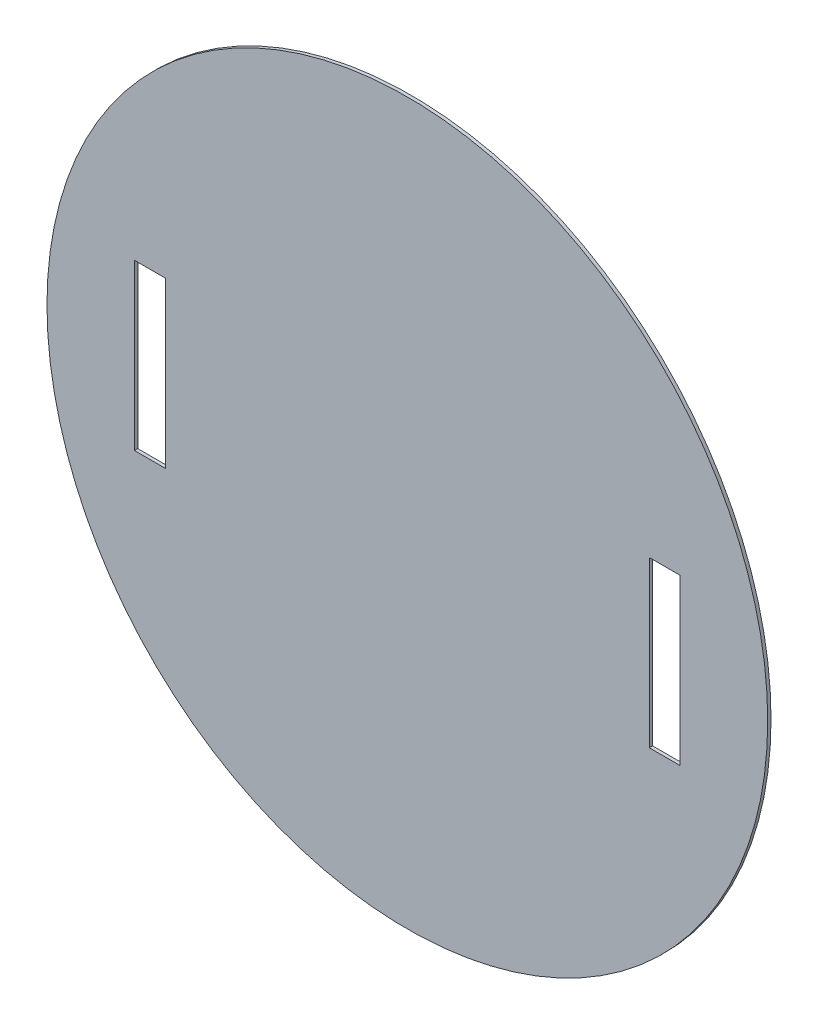
ISO-10303-21;
HEADER;
FILE_DESCRIPTION(('STEP AP214'),'2;1');
FILE_NAME('part.step','',(''),(''),'','','');
FILE_SCHEMA(('AUTOMOTIVE_DESIGN { 1 0 10303 214 1 1 1 1 }'));
ENDSEC;
DATA;
#1=APPLICATION_CONTEXT('core data for automotive mechanical design processes');
#2=APPLICATION_PROTOCOL_DEFINITION('international standard','automotive_design',2000,#1);
#3=PRODUCT_CONTEXT('',#1,'mechanical');
#4=PRODUCT('Part','Part','',(#3));
#5=PRODUCT_RELATED_PRODUCT_CATEGORY('part','',(#4));
#6=PRODUCT_DEFINITION_FORMATION('','',#4);
#7=PRODUCT_DEFINITION_CONTEXT('part definition',#1,'design');
#8=PRODUCT_DEFINITION('design','',#6,#7);
#9=PRODUCT_DEFINITION_SHAPE('','',#8);
#10=(LENGTH_UNIT() NAMED_UNIT(*) SI_UNIT(.MILLI.,.METRE.));
#11=(NAMED_UNIT(*) PLANE_ANGLE_UNIT() SI_UNIT($,.RADIAN.));
#12=(NAMED_UNIT(*) SI_UNIT($,.STERADIAN.) SOLID_ANGLE_UNIT());
#13=UNCERTAINTY_MEASURE_WITH_UNIT(LENGTH_MEASURE(1.E-05),#10,'distance_accuracy_value','');
#14=(GEOMETRIC_REPRESENTATION_CONTEXT(3) GLOBAL_UNCERTAINTY_ASSIGNED_CONTEXT((#13)) GLOBAL_UNIT_ASSIGNED_CONTEXT((#10,
#11,#12)) REPRESENTATION_CONTEXT('',''));
#15=CARTESIAN_POINT('',(0.,0.,0.));
#16=DIRECTION('',(0.,0.,1.));
#17=DIRECTION('',(1.,0.,0.));
#18=AXIS2_PLACEMENT_3D('',#15,#16,#17);
#19=CARTESIAN_POINT('',(0.,0.,1.6));
#20=DIRECTION('',(0.,0.,-1.));
#21=DIRECTION('',(-1.,0.,0.));
#22=AXIS2_PLACEMENT_3D('',#19,#20,#21);
#23=CYLINDRICAL_SURFACE('',#22,175.);
#24=CARTESIAN_POINT('',(0.,0.,1.6));
#25=DIRECTION('',(0.,0.,1.));
#26=DIRECTION('',(1.,0.,0.));
#27=AXIS2_PLACEMENT_3D('',#24,#25,#26);
#28=CIRCLE('',#27,175.);
#29=CARTESIAN_POINT('',(175.,0.,1.6));
#30=VERTEX_POINT('',#29);
#31=EDGE_CURVE('E11',#30,#30,#28,.T.);
#32=ORIENTED_EDGE('',*,*,#31,.F.);
#33=EDGE_LOOP('',(#32));
#34=FACE_BOUND('',#33,.T.);
#35=CARTESIAN_POINT('',(0.,0.,0.));
#36=DIRECTION('',(0.,0.,1.));
#37=DIRECTION('',(1.,0.,0.));
#38=AXIS2_PLACEMENT_3D('',#35,#36,#37);
#39=CIRCLE('',#38,175.);
#40=CARTESIAN_POINT('',(175.,0.,0.));
#41=VERTEX_POINT('',#40);
#42=EDGE_CURVE('E36',#41,#41,#39,.T.);
#43=ORIENTED_EDGE('',*,*,#42,.T.);
#44=EDGE_LOOP('',(#43));
#45=FACE_BOUND('',#44,.T.);
#46=ADVANCED_FACE('F33',(#34,#45),#23,.T.);
#47=CARTESIAN_POINT('',(0.,0.,1.6));
#48=DIRECTION('',(0.,0.,1.));
#49=DIRECTION('',(1.,0.,0.));
#50=AXIS2_PLACEMENT_3D('',#47,#48,#49);
#51=PLANE('',#50);
#52=DIRECTION('',(0.,-1.,0.));
#53=VECTOR('',#52,1.);
#54=CARTESIAN_POINT('',(-132.5,40.,1.6));
#55=LINE('',#54,#53);
#56=CARTESIAN_POINT('',(-132.5,40.,1.6));
#57=VERTEX_POINT('',#56);
#58=CARTESIAN_POINT('',(-132.5,-40.,1.6));
#59=VERTEX_POINT('',#58);
#60=EDGE_CURVE('E47',#57,#59,#55,.T.);
#61=ORIENTED_EDGE('',*,*,#60,.F.);
#62=DIRECTION('',(-1.,0.,0.));
#63=VECTOR('',#62,1.);
#64=CARTESIAN_POINT('',(-132.5,40.,1.6));
#65=LINE('',#64,#63);
#66=CARTESIAN_POINT('',(-117.5,40.,1.6));
#67=VERTEX_POINT('',#66);
#68=EDGE_CURVE('E118',#67,#57,#65,.T.);
#69=ORIENTED_EDGE('',*,*,#68,.F.);
#70=DIRECTION('',(0.,1.,0.));
#71=VECTOR('',#70,1.);
#72=CARTESIAN_POINT('',(-117.5,40.,1.6));
#73=LINE('',#72,#71);
#74=CARTESIAN_POINT('',(-117.5,-40.,1.6));
#75=VERTEX_POINT('',#74);
#76=EDGE_CURVE('E121',#75,#67,#73,.T.);
#77=ORIENTED_EDGE('',*,*,#76,.F.);
#78=DIRECTION('',(1.,0.,0.));
#79=VECTOR('',#78,1.);
#80=CARTESIAN_POINT('',(-132.5,-40.,1.6));
#81=LINE('',#80,#79);
#82=EDGE_CURVE('E127',#59,#75,#81,.T.);
#83=ORIENTED_EDGE('',*,*,#82,.F.);
#84=EDGE_LOOP('',(#61,#69,#77,#83));
#85=FACE_BOUND('',#84,.T.);
#86=DIRECTION('',(0.,1.,0.));
#87=VECTOR('',#86,1.);
#88=CARTESIAN_POINT('',(132.5,40.,1.6));
#89=LINE('',#88,#87);
#90=CARTESIAN_POINT('',(132.5,-40.,1.6));
#91=VERTEX_POINT('',#90);
#92=CARTESIAN_POINT('',(132.5,40.,1.6));
#93=VERTEX_POINT('',#92);
#94=EDGE_CURVE('E55',#91,#93,#89,.T.);
#95=ORIENTED_EDGE('',*,*,#94,.F.);
#96=DIRECTION('',(1.,0.,0.));
#97=VECTOR('',#96,1.);
#98=CARTESIAN_POINT('',(132.5,-40.,1.6));
#99=LINE('',#98,#97);
#100=CARTESIAN_POINT('',(117.5,-40.,1.6));
#101=VERTEX_POINT('',#100);
#102=EDGE_CURVE('E141',#101,#91,#99,.T.);
#103=ORIENTED_EDGE('',*,*,#102,.F.);
#104=DIRECTION('',(0.,-1.,0.));
#105=VECTOR('',#104,1.);
#106=CARTESIAN_POINT('',(117.5,40.,1.6));
#107=LINE('',#106,#105);
#108=CARTESIAN_POINT('',(117.5,40.,1.6));
#109=VERTEX_POINT('',#108);
#110=EDGE_CURVE('E155',#109,#101,#107,.T.);
#111=ORIENTED_EDGE('',*,*,#110,.F.);
#112=DIRECTION('',(-1.,0.,0.));
#113=VECTOR('',#112,1.);
#114=CARTESIAN_POINT('',(132.5,40.,1.6));
#115=LINE('',#114,#113);
#116=EDGE_CURVE('E152',#93,#109,#115,.T.);
#117=ORIENTED_EDGE('',*,*,#116,.F.);
#118=EDGE_LOOP('',(#95,#103,#111,#117));
#119=FACE_BOUND('',#118,.T.);
#120=ORIENTED_EDGE('',*,*,#31,.T.);
#121=EDGE_LOOP('',(#120));
#122=FACE_BOUND('',#121,.T.);
#123=ADVANCED_FACE('F173',(#85,#119,#122),#51,.T.);
#124=CARTESIAN_POINT('',(0.,0.,0.));
#125=DIRECTION('',(0.,0.,1.));
#126=DIRECTION('',(1.,0.,0.));
#127=AXIS2_PLACEMENT_3D('',#124,#125,#126);
#128=PLANE('',#127);
#129=DIRECTION('',(-1.,0.,0.));
#130=VECTOR('',#129,1.);
#131=CARTESIAN_POINT('',(-132.5,40.,0.));
#132=LINE('',#131,#130);
#133=CARTESIAN_POINT('',(-117.5,40.,0.));
#134=VERTEX_POINT('',#133);
#135=CARTESIAN_POINT('',(-132.5,40.,0.));
#136=VERTEX_POINT('',#135);
#137=EDGE_CURVE('E105',#134,#136,#132,.T.);
#138=ORIENTED_EDGE('',*,*,#137,.T.);
#139=DIRECTION('',(0.,-1.,0.));
#140=VECTOR('',#139,1.);
#141=CARTESIAN_POINT('',(-132.5,40.,0.));
#142=LINE('',#141,#140);
#143=CARTESIAN_POINT('',(-132.5,-40.,0.));
#144=VERTEX_POINT('',#143);
#145=EDGE_CURVE('E99',#136,#144,#142,.T.);
#146=ORIENTED_EDGE('',*,*,#145,.T.);
#147=DIRECTION('',(1.,0.,0.));
#148=VECTOR('',#147,1.);
#149=CARTESIAN_POINT('',(-132.5,-40.,0.));
#150=LINE('',#149,#148);
#151=CARTESIAN_POINT('',(-117.5,-40.,0.));
#152=VERTEX_POINT('',#151);
#153=EDGE_CURVE('E109',#144,#152,#150,.T.);
#154=ORIENTED_EDGE('',*,*,#153,.T.);
#155=DIRECTION('',(0.,1.,0.));
#156=VECTOR('',#155,1.);
#157=CARTESIAN_POINT('',(-117.5,40.,0.));
#158=LINE('',#157,#156);
#159=EDGE_CURVE('E113',#152,#134,#158,.T.);
#160=ORIENTED_EDGE('',*,*,#159,.T.);
#161=EDGE_LOOP('',(#138,#146,#154,#160));
#162=FACE_BOUND('',#161,.T.);
#163=DIRECTION('',(1.,0.,0.));
#164=VECTOR('',#163,1.);
#165=CARTESIAN_POINT('',(132.5,-40.,0.));
#166=LINE('',#165,#164);
#167=CARTESIAN_POINT('',(117.5,-40.,0.));
#168=VERTEX_POINT('',#167);
#169=CARTESIAN_POINT('',(132.5,-40.,0.));
#170=VERTEX_POINT('',#169);
#171=EDGE_CURVE('E147',#168,#170,#166,.T.);
#172=ORIENTED_EDGE('',*,*,#171,.T.);
#173=DIRECTION('',(0.,1.,0.));
#174=VECTOR('',#173,1.);
#175=CARTESIAN_POINT('',(132.5,40.,0.));
#176=LINE('',#175,#174);
#177=CARTESIAN_POINT('',(132.5,40.,0.));
#178=VERTEX_POINT('',#177);
#179=EDGE_CURVE('E137',#170,#178,#176,.T.);
#180=ORIENTED_EDGE('',*,*,#179,.T.);
#181=DIRECTION('',(-1.,0.,0.));
#182=VECTOR('',#181,1.);
#183=CARTESIAN_POINT('',(132.5,40.,0.));
#184=LINE('',#183,#182);
#185=CARTESIAN_POINT('',(117.5,40.,0.));
#186=VERTEX_POINT('',#185);
#187=EDGE_CURVE('E140',#178,#186,#184,.T.);
#188=ORIENTED_EDGE('',*,*,#187,.T.);
#189=DIRECTION('',(0.,-1.,0.));
#190=VECTOR('',#189,1.);
#191=CARTESIAN_POINT('',(117.5,40.,0.));
#192=LINE('',#191,#190);
#193=EDGE_CURVE('E144',#186,#168,#192,.T.);
#194=ORIENTED_EDGE('',*,*,#193,.T.);
#195=EDGE_LOOP('',(#172,#180,#188,#194));
#196=FACE_BOUND('',#195,.T.);
#197=ORIENTED_EDGE('',*,*,#42,.F.);
#198=EDGE_LOOP('',(#197));
#199=FACE_BOUND('',#198,.T.);
#200=ADVANCED_FACE('F115',(#162,#196,#199),#128,.F.);
#201=CARTESIAN_POINT('',(132.5,40.,0.));
#202=DIRECTION('',(1.,0.,0.));
#203=DIRECTION('',(0.,0.,-1.));
#204=AXIS2_PLACEMENT_3D('',#201,#202,#203);
#205=PLANE('',#204);
#206=ORIENTED_EDGE('',*,*,#94,.T.);
#207=DIRECTION('',(0.,0.,1.));
#208=VECTOR('',#207,1.);
#209=CARTESIAN_POINT('',(132.5,40.,0.));
#210=LINE('',#209,#208);
#211=EDGE_CURVE('E150',#178,#93,#210,.T.);
#212=ORIENTED_EDGE('',*,*,#211,.F.);
#213=ORIENTED_EDGE('',*,*,#179,.F.);
#214=DIRECTION('',(0.,0.,1.));
#215=VECTOR('',#214,1.);
#216=CARTESIAN_POINT('',(132.5,-40.,0.));
#217=LINE('',#216,#215);
#218=EDGE_CURVE('E128',#170,#91,#217,.T.);
#219=ORIENTED_EDGE('',*,*,#218,.T.);
#220=EDGE_LOOP('',(#206,#212,#213,#219));
#221=FACE_BOUND('',#220,.T.);
#222=ADVANCED_FACE('F180',(#221),#205,.F.);
#223=CARTESIAN_POINT('',(132.5,-40.,0.));
#224=DIRECTION('',(0.,-1.,0.));
#225=DIRECTION('',(0.,0.,-1.));
#226=AXIS2_PLACEMENT_3D('',#223,#224,#225);
#227=PLANE('',#226);
#228=ORIENTED_EDGE('',*,*,#102,.T.);
#229=ORIENTED_EDGE('',*,*,#218,.F.);
#230=ORIENTED_EDGE('',*,*,#171,.F.);
#231=DIRECTION('',(0.,0.,1.));
#232=VECTOR('',#231,1.);
#233=CARTESIAN_POINT('',(117.5,-40.,0.));
#234=LINE('',#233,#232);
#235=EDGE_CURVE('E161',#168,#101,#234,.T.);
#236=ORIENTED_EDGE('',*,*,#235,.T.);
#237=EDGE_LOOP('',(#228,#229,#230,#236));
#238=FACE_BOUND('',#237,.T.);
#239=ADVANCED_FACE('F182',(#238),#227,.F.);
#240=CARTESIAN_POINT('',(117.5,40.,0.));
#241=DIRECTION('',(-1.,0.,0.));
#242=DIRECTION('',(0.,0.,1.));
#243=AXIS2_PLACEMENT_3D('',#240,#241,#242);
#244=PLANE('',#243);
#245=ORIENTED_EDGE('',*,*,#110,.T.);
#246=ORIENTED_EDGE('',*,*,#235,.F.);
#247=ORIENTED_EDGE('',*,*,#193,.F.);
#248=DIRECTION('',(0.,0.,1.));
#249=VECTOR('',#248,1.);
#250=CARTESIAN_POINT('',(117.5,40.,0.));
#251=LINE('',#250,#249);
#252=EDGE_CURVE('E163',#186,#109,#251,.T.);
#253=ORIENTED_EDGE('',*,*,#252,.T.);
#254=EDGE_LOOP('',(#245,#246,#247,#253));
#255=FACE_BOUND('',#254,.T.);
#256=ADVANCED_FACE('F177',(#255),#244,.F.);
#257=CARTESIAN_POINT('',(132.5,40.,0.));
#258=DIRECTION('',(0.,1.,0.));
#259=DIRECTION('',(0.,0.,1.));
#260=AXIS2_PLACEMENT_3D('',#257,#258,#259);
#261=PLANE('',#260);
#262=ORIENTED_EDGE('',*,*,#116,.T.);
#263=ORIENTED_EDGE('',*,*,#252,.F.);
#264=ORIENTED_EDGE('',*,*,#187,.F.);
#265=ORIENTED_EDGE('',*,*,#211,.T.);
#266=EDGE_LOOP('',(#262,#263,#264,#265));
#267=FACE_BOUND('',#266,.T.);
#268=ADVANCED_FACE('F168',(#267),#261,.F.);
#269=CARTESIAN_POINT('',(-132.5,40.,0.));
#270=DIRECTION('',(-1.,0.,0.));
#271=DIRECTION('',(0.,0.,1.));
#272=AXIS2_PLACEMENT_3D('',#269,#270,#271);
#273=PLANE('',#272);
#274=ORIENTED_EDGE('',*,*,#60,.T.);
#275=DIRECTION('',(0.,0.,1.));
#276=VECTOR('',#275,1.);
#277=CARTESIAN_POINT('',(-132.5,-40.,0.));
#278=LINE('',#277,#276);
#279=EDGE_CURVE('E95',#144,#59,#278,.T.);
#280=ORIENTED_EDGE('',*,*,#279,.F.);
#281=ORIENTED_EDGE('',*,*,#145,.F.);
#282=DIRECTION('',(0.,0.,1.));
#283=VECTOR('',#282,1.);
#284=CARTESIAN_POINT('',(-132.5,40.,0.));
#285=LINE('',#284,#283);
#286=EDGE_CURVE('E132',#136,#57,#285,.T.);
#287=ORIENTED_EDGE('',*,*,#286,.T.);
#288=EDGE_LOOP('',(#274,#280,#281,#287));
#289=FACE_BOUND('',#288,.T.);
#290=ADVANCED_FACE('F97',(#289),#273,.F.);
#291=CARTESIAN_POINT('',(-132.5,40.,0.));
#292=DIRECTION('',(0.,1.,0.));
#293=DIRECTION('',(0.,0.,1.));
#294=AXIS2_PLACEMENT_3D('',#291,#292,#293);
#295=PLANE('',#294);
#296=ORIENTED_EDGE('',*,*,#68,.T.);
#297=ORIENTED_EDGE('',*,*,#286,.F.);
#298=ORIENTED_EDGE('',*,*,#137,.F.);
#299=DIRECTION('',(0.,0.,1.));
#300=VECTOR('',#299,1.);
#301=CARTESIAN_POINT('',(-117.5,40.,0.));
#302=LINE('',#301,#300);
#303=EDGE_CURVE('E134',#134,#67,#302,.T.);
#304=ORIENTED_EDGE('',*,*,#303,.T.);
#305=EDGE_LOOP('',(#296,#297,#298,#304));
#306=FACE_BOUND('',#305,.T.);
#307=ADVANCED_FACE('F211',(#306),#295,.F.);
#308=CARTESIAN_POINT('',(-117.5,40.,0.));
#309=DIRECTION('',(1.,0.,0.));
#310=DIRECTION('',(0.,0.,-1.));
#311=AXIS2_PLACEMENT_3D('',#308,#309,#310);
#312=PLANE('',#311);
#313=ORIENTED_EDGE('',*,*,#76,.T.);
#314=ORIENTED_EDGE('',*,*,#303,.F.);
#315=ORIENTED_EDGE('',*,*,#159,.F.);
#316=DIRECTION('',(0.,0.,1.));
#317=VECTOR('',#316,1.);
#318=CARTESIAN_POINT('',(-117.5,-40.,0.));
#319=LINE('',#318,#317);
#320=EDGE_CURVE('E104',#152,#75,#319,.T.);
#321=ORIENTED_EDGE('',*,*,#320,.T.);
#322=EDGE_LOOP('',(#313,#314,#315,#321));
#323=FACE_BOUND('',#322,.T.);
#324=ADVANCED_FACE('F215',(#323),#312,.F.);
#325=CARTESIAN_POINT('',(-132.5,-40.,0.));
#326=DIRECTION('',(0.,-1.,0.));
#327=DIRECTION('',(0.,0.,-1.));
#328=AXIS2_PLACEMENT_3D('',#325,#326,#327);
#329=PLANE('',#328);
#330=ORIENTED_EDGE('',*,*,#82,.T.);
#331=ORIENTED_EDGE('',*,*,#320,.F.);
#332=ORIENTED_EDGE('',*,*,#153,.F.);
#333=ORIENTED_EDGE('',*,*,#279,.T.);
#334=EDGE_LOOP('',(#330,#331,#332,#333));
#335=FACE_BOUND('',#334,.T.);
#336=ADVANCED_FACE('F110',(#335),#329,.F.);
#337=CLOSED_SHELL('',(#46,#123,#200,#222,#239,#256,#268,#290,#307,#324,#336));
#338=MANIFOLD_SOLID_BREP('B2',#337);
#339=ADVANCED_BREP_SHAPE_REPRESENTATION('',(#18,#338),#14);
#340=SHAPE_DEFINITION_REPRESENTATION(#9,#339);
ENDSEC;
END-ISO-10303-21;
